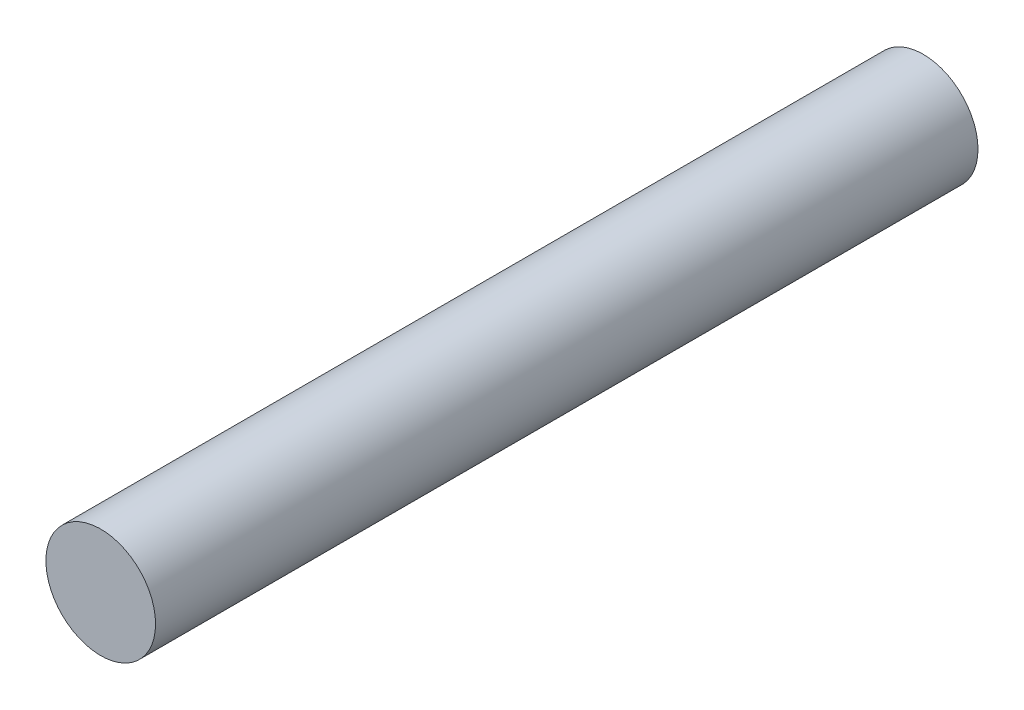
ISO-10303-21;
HEADER;
FILE_DESCRIPTION(('STEP AP214'),'2;1');
FILE_NAME('part.step','',(''),(''),'','','');
FILE_SCHEMA(('AUTOMOTIVE_DESIGN { 1 0 10303 214 1 1 1 1 }'));
ENDSEC;
DATA;
#1=APPLICATION_CONTEXT('core data for automotive mechanical design processes');
#2=APPLICATION_PROTOCOL_DEFINITION('international standard','automotive_design',2000,#1);
#3=PRODUCT_CONTEXT('',#1,'mechanical');
#4=PRODUCT('Part','Part','',(#3));
#5=PRODUCT_RELATED_PRODUCT_CATEGORY('part','',(#4));
#6=PRODUCT_DEFINITION_FORMATION('','',#4);
#7=PRODUCT_DEFINITION_CONTEXT('part definition',#1,'design');
#8=PRODUCT_DEFINITION('design','',#6,#7);
#9=PRODUCT_DEFINITION_SHAPE('','',#8);
#10=(LENGTH_UNIT() NAMED_UNIT(*) SI_UNIT(.MILLI.,.METRE.));
#11=(NAMED_UNIT(*) PLANE_ANGLE_UNIT() SI_UNIT($,.RADIAN.));
#12=(NAMED_UNIT(*) SI_UNIT($,.STERADIAN.) SOLID_ANGLE_UNIT());
#13=UNCERTAINTY_MEASURE_WITH_UNIT(LENGTH_MEASURE(1.E-05),#10,'distance_accuracy_value','');
#14=(GEOMETRIC_REPRESENTATION_CONTEXT(3) GLOBAL_UNCERTAINTY_ASSIGNED_CONTEXT((#13)) GLOBAL_UNIT_ASSIGNED_CONTEXT((#10,
#11,#12)) REPRESENTATION_CONTEXT('',''));
#15=CARTESIAN_POINT('',(0.,0.,0.));
#16=DIRECTION('',(0.,0.,1.));
#17=DIRECTION('',(1.,0.,0.));
#18=AXIS2_PLACEMENT_3D('',#15,#16,#17);
#19=CARTESIAN_POINT('',(0.,0.,38.1));
#20=DIRECTION('',(0.,0.,-1.));
#21=DIRECTION('',(-1.,0.,0.));
#22=AXIS2_PLACEMENT_3D('',#19,#20,#21);
#23=CYLINDRICAL_SURFACE('',#22,2.54);
#24=CARTESIAN_POINT('',(0.,0.,38.1));
#25=DIRECTION('',(0.,0.,1.));
#26=DIRECTION('',(1.,0.,0.));
#27=AXIS2_PLACEMENT_3D('',#24,#25,#26);
#28=CIRCLE('',#27,2.54);
#29=CARTESIAN_POINT('',(2.54,0.,38.1));
#30=VERTEX_POINT('',#29);
#31=EDGE_CURVE('E10',#30,#30,#28,.T.);
#32=ORIENTED_EDGE('',*,*,#31,.F.);
#33=EDGE_LOOP('',(#32));
#34=FACE_BOUND('',#33,.T.);
#35=CARTESIAN_POINT('',(0.,0.,0.));
#36=DIRECTION('',(0.,0.,1.));
#37=DIRECTION('',(1.,0.,0.));
#38=AXIS2_PLACEMENT_3D('',#35,#36,#37);
#39=CIRCLE('',#38,2.54);
#40=CARTESIAN_POINT('',(2.54,0.,0.));
#41=VERTEX_POINT('',#40);
#42=EDGE_CURVE('E36',#41,#41,#39,.T.);
#43=ORIENTED_EDGE('',*,*,#42,.T.);
#44=EDGE_LOOP('',(#43));
#45=FACE_BOUND('',#44,.T.);
#46=ADVANCED_FACE('F30',(#34,#45),#23,.T.);
#47=CARTESIAN_POINT('',(0.,0.,38.1));
#48=DIRECTION('',(0.,0.,1.));
#49=DIRECTION('',(1.,0.,0.));
#50=AXIS2_PLACEMENT_3D('',#47,#48,#49);
#51=PLANE('',#50);
#52=ORIENTED_EDGE('',*,*,#31,.T.);
#53=EDGE_LOOP('',(#52));
#54=FACE_BOUND('',#53,.T.);
#55=ADVANCED_FACE('F45',(#54),#51,.T.);
#56=CARTESIAN_POINT('',(0.,0.,0.));
#57=DIRECTION('',(0.,0.,1.));
#58=DIRECTION('',(1.,0.,0.));
#59=AXIS2_PLACEMENT_3D('',#56,#57,#58);
#60=PLANE('',#59);
#61=ORIENTED_EDGE('',*,*,#42,.F.);
#62=EDGE_LOOP('',(#61));
#63=FACE_BOUND('',#62,.T.);
#64=ADVANCED_FACE('F43',(#63),#60,.F.);
#65=CLOSED_SHELL('',(#46,#55,#64));
#66=MANIFOLD_SOLID_BREP('B2',#65);
#67=ADVANCED_BREP_SHAPE_REPRESENTATION('',(#18,#66),#14);
#68=SHAPE_DEFINITION_REPRESENTATION(#9,#67);
ENDSEC;
END-ISO-10303-21;
